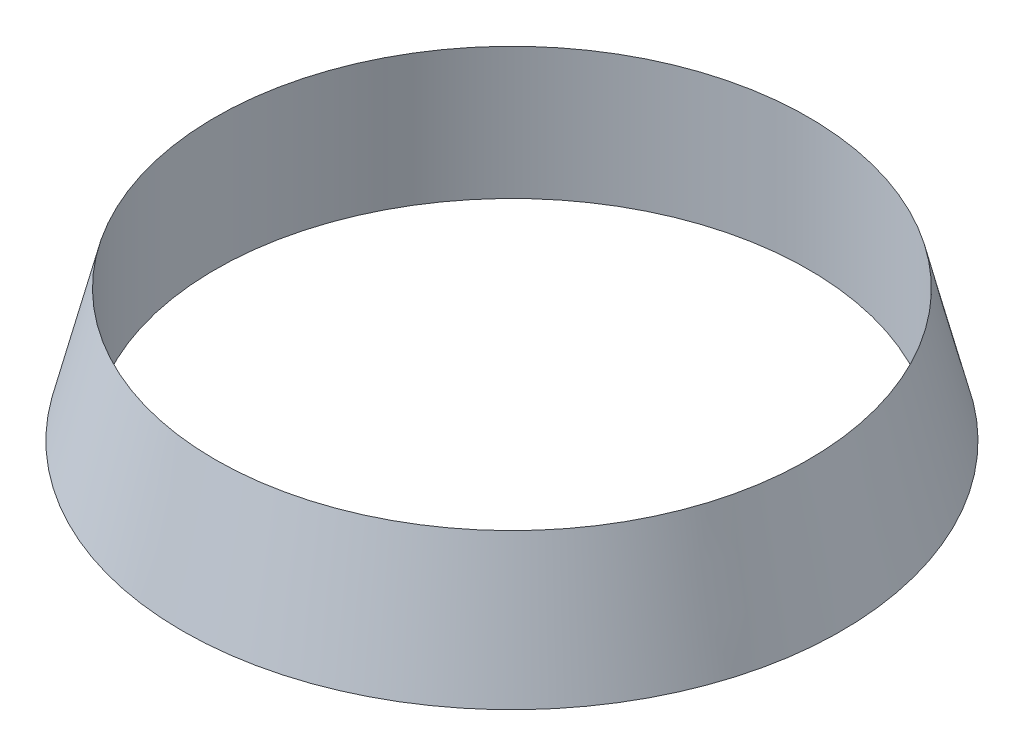
ISO-10303-21;
HEADER;
FILE_DESCRIPTION(('STEP AP214'),'2;1');
FILE_NAME('part.step','',(''),(''),'','','');
FILE_SCHEMA(('AUTOMOTIVE_DESIGN { 1 0 10303 214 1 1 1 1 }'));
ENDSEC;
DATA;
#1=APPLICATION_CONTEXT('core data for automotive mechanical design processes');
#2=APPLICATION_PROTOCOL_DEFINITION('international standard','automotive_design',2000,#1);
#3=PRODUCT_CONTEXT('',#1,'mechanical');
#4=PRODUCT('Part','Part','',(#3));
#5=PRODUCT_RELATED_PRODUCT_CATEGORY('part','',(#4));
#6=PRODUCT_DEFINITION_FORMATION('','',#4);
#7=PRODUCT_DEFINITION_CONTEXT('part definition',#1,'design');
#8=PRODUCT_DEFINITION('design','',#6,#7);
#9=PRODUCT_DEFINITION_SHAPE('','',#8);
#10=(LENGTH_UNIT() NAMED_UNIT(*) SI_UNIT(.MILLI.,.METRE.));
#11=(NAMED_UNIT(*) PLANE_ANGLE_UNIT() SI_UNIT($,.RADIAN.));
#12=(NAMED_UNIT(*) SI_UNIT($,.STERADIAN.) SOLID_ANGLE_UNIT());
#13=UNCERTAINTY_MEASURE_WITH_UNIT(LENGTH_MEASURE(1.E-05),#10,'distance_accuracy_value','');
#14=(GEOMETRIC_REPRESENTATION_CONTEXT(3) GLOBAL_UNCERTAINTY_ASSIGNED_CONTEXT((#13)) GLOBAL_UNIT_ASSIGNED_CONTEXT((#10,
#11,#12)) REPRESENTATION_CONTEXT('',''));
#15=CARTESIAN_POINT('',(0.,0.,0.));
#16=DIRECTION('',(0.,0.,1.));
#17=DIRECTION('',(1.,0.,0.));
#18=AXIS2_PLACEMENT_3D('',#15,#16,#17);
#19=CARTESIAN_POINT('',(0.,0.,0.));
#20=DIRECTION('',(0.,1.,0.));
#21=DIRECTION('',(0.,0.,1.));
#22=AXIS2_PLACEMENT_3D('',#19,#20,#21);
#23=PLANE('',#22);
#24=CARTESIAN_POINT('',(0.,0.,0.));
#25=DIRECTION('',(0.,1.,0.));
#26=DIRECTION('',(0.,0.,1.));
#27=AXIS2_PLACEMENT_3D('',#24,#25,#26);
#28=CIRCLE('',#27,45.);
#29=CARTESIAN_POINT('',(0.,0.,45.));
#30=VERTEX_POINT('',#29);
#31=EDGE_CURVE('E52',#30,#30,#28,.T.);
#32=ORIENTED_EDGE('',*,*,#31,.T.);
#33=EDGE_LOOP('',(#32));
#34=FACE_BOUND('',#33,.T.);
#35=CARTESIAN_POINT('',(0.,0.,0.));
#36=DIRECTION('',(0.,1.,0.));
#37=DIRECTION('',(0.,0.,1.));
#38=AXIS2_PLACEMENT_3D('',#35,#36,#37);
#39=CIRCLE('',#38,50.);
#40=CARTESIAN_POINT('',(0.,0.,50.));
#41=VERTEX_POINT('',#40);
#42=EDGE_CURVE('E11',#41,#41,#39,.T.);
#43=ORIENTED_EDGE('',*,*,#42,.F.);
#44=EDGE_LOOP('',(#43));
#45=FACE_BOUND('',#44,.T.);
#46=ADVANCED_FACE('F42',(#34,#45),#23,.F.);
#47=CARTESIAN_POINT('',(0.,20.,0.));
#48=DIRECTION('',(0.,-1.,0.));
#49=DIRECTION('',(0.,0.,-1.));
#50=AXIS2_PLACEMENT_3D('',#47,#48,#49);
#51=CONICAL_SURFACE('',#50,45.,0.244978663126864);
#52=ORIENTED_EDGE('',*,*,#42,.T.);
#53=EDGE_LOOP('',(#52));
#54=FACE_BOUND('',#53,.T.);
#55=CARTESIAN_POINT('',(0.,20.,0.));
#56=DIRECTION('',(0.,1.,0.));
#57=DIRECTION('',(0.,0.,1.));
#58=AXIS2_PLACEMENT_3D('',#55,#56,#57);
#59=CIRCLE('',#58,45.);
#60=CARTESIAN_POINT('',(0.,20.,45.));
#61=VERTEX_POINT('',#60);
#62=EDGE_CURVE('E60',#61,#61,#59,.T.);
#63=ORIENTED_EDGE('',*,*,#62,.F.);
#64=EDGE_LOOP('',(#63));
#65=FACE_BOUND('',#64,.T.);
#66=ADVANCED_FACE('F44',(#54,#65),#51,.T.);
#67=CARTESIAN_POINT('',(0.,-9.99999999994061E-05,0.));
#68=DIRECTION('',(0.,1.,0.));
#69=DIRECTION('',(0.,0.,1.));
#70=AXIS2_PLACEMENT_3D('',#67,#68,#69);
#71=CYLINDRICAL_SURFACE('',#70,45.);
#72=ORIENTED_EDGE('',*,*,#62,.T.);
#73=EDGE_LOOP('',(#72));
#74=FACE_BOUND('',#73,.T.);
#75=ORIENTED_EDGE('',*,*,#31,.F.);
#76=EDGE_LOOP('',(#75));
#77=FACE_BOUND('',#76,.T.);
#78=ADVANCED_FACE('F76',(#74,#77),#71,.F.);
#79=CLOSED_SHELL('',(#46,#66,#78));
#80=MANIFOLD_SOLID_BREP('B2',#79);
#81=ADVANCED_BREP_SHAPE_REPRESENTATION('',(#18,#80),#14);
#82=SHAPE_DEFINITION_REPRESENTATION(#9,#81);
ENDSEC;
END-ISO-10303-21;
